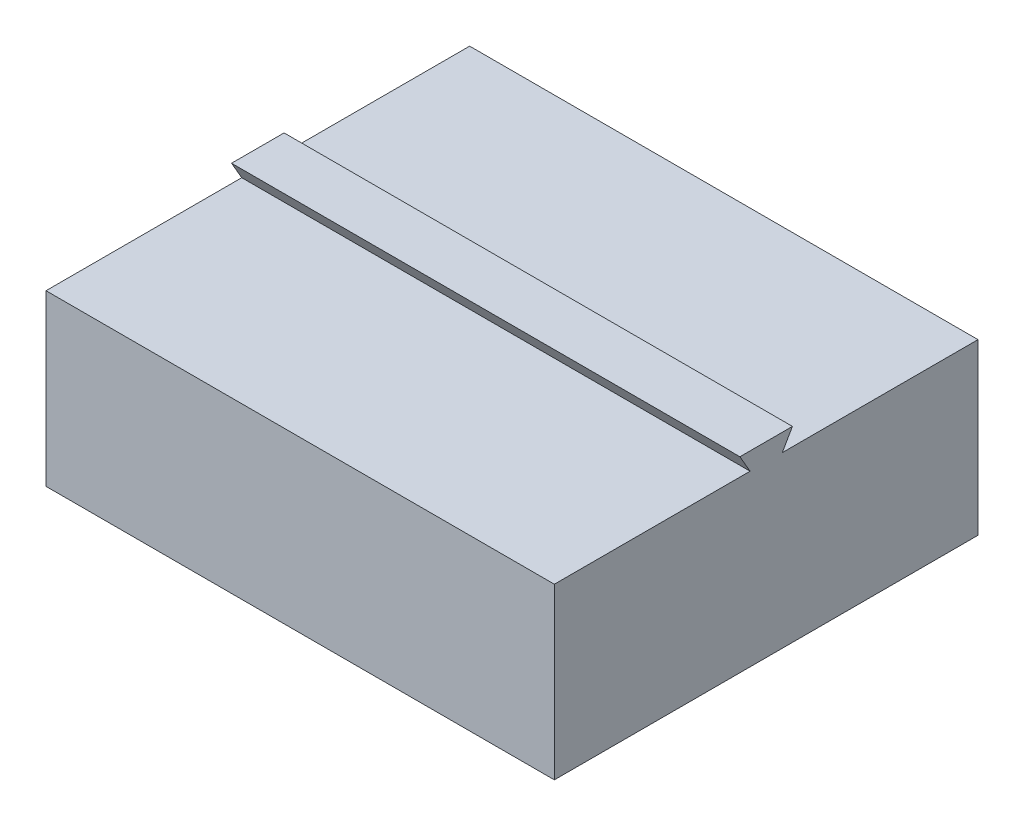
ISO-10303-21;
HEADER;
FILE_DESCRIPTION(('STEP AP214'),'2;1');
FILE_NAME('part.step','',(''),(''),'','','');
FILE_SCHEMA(('AUTOMOTIVE_DESIGN { 1 0 10303 214 1 1 1 1 }'));
ENDSEC;
DATA;
#1=APPLICATION_CONTEXT('core data for automotive mechanical design processes');
#2=APPLICATION_PROTOCOL_DEFINITION('international standard','automotive_design',2000,#1);
#3=PRODUCT_CONTEXT('',#1,'mechanical');
#4=PRODUCT('Part','Part','',(#3));
#5=PRODUCT_RELATED_PRODUCT_CATEGORY('part','',(#4));
#6=PRODUCT_DEFINITION_FORMATION('','',#4);
#7=PRODUCT_DEFINITION_CONTEXT('part definition',#1,'design');
#8=PRODUCT_DEFINITION('design','',#6,#7);
#9=PRODUCT_DEFINITION_SHAPE('','',#8);
#10=(LENGTH_UNIT() NAMED_UNIT(*) SI_UNIT(.MILLI.,.METRE.));
#11=(NAMED_UNIT(*) PLANE_ANGLE_UNIT() SI_UNIT($,.RADIAN.));
#12=(NAMED_UNIT(*) SI_UNIT($,.STERADIAN.) SOLID_ANGLE_UNIT());
#13=UNCERTAINTY_MEASURE_WITH_UNIT(LENGTH_MEASURE(1.E-05),#10,'distance_accuracy_value','');
#14=(GEOMETRIC_REPRESENTATION_CONTEXT(3) GLOBAL_UNCERTAINTY_ASSIGNED_CONTEXT((#13)) GLOBAL_UNIT_ASSIGNED_CONTEXT((#10,
#11,#12)) REPRESENTATION_CONTEXT('',''));
#15=CARTESIAN_POINT('',(0.,0.,0.));
#16=DIRECTION('',(0.,0.,1.));
#17=DIRECTION('',(1.,0.,0.));
#18=AXIS2_PLACEMENT_3D('',#15,#16,#17);
#19=CARTESIAN_POINT('',(0.,40.,0.));
#20=DIRECTION('',(0.,1.,0.));
#21=DIRECTION('',(0.,0.,1.));
#22=AXIS2_PLACEMENT_3D('',#19,#20,#21);
#23=PLANE('',#22);
#24=DIRECTION('',(0.,0.,1.));
#25=VECTOR('',#24,1.);
#26=CARTESIAN_POINT('',(-60.,40.,50.));
#27=LINE('',#26,#25);
#28=CARTESIAN_POINT('',(-60.,40.,-50.));
#29=VERTEX_POINT('',#28);
#30=CARTESIAN_POINT('',(-60.,40.,-3.8));
#31=VERTEX_POINT('',#30);
#32=EDGE_CURVE('E231',#29,#31,#27,.T.);
#33=ORIENTED_EDGE('',*,*,#32,.T.);
#34=DIRECTION('',(1.,0.,0.));
#35=VECTOR('',#34,1.);
#36=CARTESIAN_POINT('',(-73.0825745851545,40.,-3.8));
#37=LINE('',#36,#35);
#38=CARTESIAN_POINT('',(60.,40.,-3.79999999999998));
#39=VERTEX_POINT('',#38);
#40=EDGE_CURVE('E60',#31,#39,#37,.T.);
#41=ORIENTED_EDGE('',*,*,#40,.T.);
#42=DIRECTION('',(0.,0.,-1.));
#43=VECTOR('',#42,1.);
#44=CARTESIAN_POINT('',(60.,40.,50.));
#45=LINE('',#44,#43);
#46=CARTESIAN_POINT('',(60.,40.,-50.));
#47=VERTEX_POINT('',#46);
#48=EDGE_CURVE('E236',#39,#47,#45,.T.);
#49=ORIENTED_EDGE('',*,*,#48,.T.);
#50=DIRECTION('',(-1.,0.,0.));
#51=VECTOR('',#50,1.);
#52=CARTESIAN_POINT('',(60.,40.,-50.));
#53=LINE('',#52,#51);
#54=EDGE_CURVE('E239',#47,#29,#53,.T.);
#55=ORIENTED_EDGE('',*,*,#54,.T.);
#56=EDGE_LOOP('',(#33,#41,#49,#55));
#57=FACE_BOUND('',#56,.T.);
#58=ADVANCED_FACE('F37',(#57),#23,.T.);
#59=CARTESIAN_POINT('',(-60.,40.,50.));
#60=DIRECTION('',(1.,0.,0.));
#61=DIRECTION('',(0.,0.,-1.));
#62=AXIS2_PLACEMENT_3D('',#59,#60,#61);
#63=PLANE('',#62);
#64=DIRECTION('',(0.,0.,1.));
#65=VECTOR('',#64,1.);
#66=CARTESIAN_POINT('',(-60.,0.,50.));
#67=LINE('',#66,#65);
#68=CARTESIAN_POINT('',(-60.,0.,-50.));
#69=VERTEX_POINT('',#68);
#70=CARTESIAN_POINT('',(-60.,0.,50.));
#71=VERTEX_POINT('',#70);
#72=EDGE_CURVE('E230',#69,#71,#67,.T.);
#73=ORIENTED_EDGE('',*,*,#72,.T.);
#74=DIRECTION('',(0.,-1.,0.));
#75=VECTOR('',#74,1.);
#76=CARTESIAN_POINT('',(-60.,40.,50.));
#77=LINE('',#76,#75);
#78=CARTESIAN_POINT('',(-60.,40.,50.));
#79=VERTEX_POINT('',#78);
#80=EDGE_CURVE('E11',#79,#71,#77,.T.);
#81=ORIENTED_EDGE('',*,*,#80,.F.);
#82=CARTESIAN_POINT('',(-60.,40.,3.8));
#83=VERTEX_POINT('',#82);
#84=EDGE_CURVE('E234',#83,#79,#27,.T.);
#85=ORIENTED_EDGE('',*,*,#84,.F.);
#86=DIRECTION('',(0.,0.866025403784436,0.500000000000005));
#87=VECTOR('',#86,1.);
#88=CARTESIAN_POINT('',(-60.,40.,3.8));
#89=LINE('',#88,#87);
#90=CARTESIAN_POINT('',(-60.,44.16,6.20177711982887));
#91=VERTEX_POINT('',#90);
#92=EDGE_CURVE('E209',#83,#91,#89,.T.);
#93=ORIENTED_EDGE('',*,*,#92,.T.);
#94=DIRECTION('',(0.,0.,-1.));
#95=VECTOR('',#94,1.);
#96=CARTESIAN_POINT('',(-60.,44.16,6.20177711982887));
#97=LINE('',#96,#95);
#98=CARTESIAN_POINT('',(-60.,44.16,-6.20177711982887));
#99=VERTEX_POINT('',#98);
#100=EDGE_CURVE('E207',#91,#99,#97,.T.);
#101=ORIENTED_EDGE('',*,*,#100,.T.);
#102=DIRECTION('',(0.,-0.866025403784436,0.500000000000005));
#103=VECTOR('',#102,1.);
#104=CARTESIAN_POINT('',(-60.,44.16,-6.20177711982887));
#105=LINE('',#104,#103);
#106=EDGE_CURVE('E212',#99,#31,#105,.T.);
#107=ORIENTED_EDGE('',*,*,#106,.T.);
#108=ORIENTED_EDGE('',*,*,#32,.F.);
#109=DIRECTION('',(0.,-1.,0.));
#110=VECTOR('',#109,1.);
#111=CARTESIAN_POINT('',(-60.,40.,-50.));
#112=LINE('',#111,#110);
#113=EDGE_CURVE('E241',#29,#69,#112,.T.);
#114=ORIENTED_EDGE('',*,*,#113,.T.);
#115=EDGE_LOOP('',(#73,#81,#85,#93,#101,#107,#108,#114));
#116=FACE_BOUND('',#115,.T.);
#117=ADVANCED_FACE('F39',(#116),#63,.F.);
#118=CARTESIAN_POINT('',(60.,40.,50.));
#119=DIRECTION('',(0.,0.,-1.));
#120=DIRECTION('',(-1.,0.,0.));
#121=AXIS2_PLACEMENT_3D('',#118,#119,#120);
#122=PLANE('',#121);
#123=DIRECTION('',(1.,0.,0.));
#124=VECTOR('',#123,1.);
#125=CARTESIAN_POINT('',(60.,0.,50.));
#126=LINE('',#125,#124);
#127=CARTESIAN_POINT('',(60.,0.,50.));
#128=VERTEX_POINT('',#127);
#129=EDGE_CURVE('E244',#71,#128,#126,.T.);
#130=ORIENTED_EDGE('',*,*,#129,.T.);
#131=DIRECTION('',(0.,-1.,0.));
#132=VECTOR('',#131,1.);
#133=CARTESIAN_POINT('',(60.,40.,50.));
#134=LINE('',#133,#132);
#135=CARTESIAN_POINT('',(60.,40.,50.));
#136=VERTEX_POINT('',#135);
#137=EDGE_CURVE('E45',#136,#128,#134,.T.);
#138=ORIENTED_EDGE('',*,*,#137,.F.);
#139=DIRECTION('',(1.,0.,0.));
#140=VECTOR('',#139,1.);
#141=CARTESIAN_POINT('',(60.,40.,50.));
#142=LINE('',#141,#140);
#143=EDGE_CURVE('E233',#79,#136,#142,.T.);
#144=ORIENTED_EDGE('',*,*,#143,.F.);
#145=ORIENTED_EDGE('',*,*,#80,.T.);
#146=EDGE_LOOP('',(#130,#138,#144,#145));
#147=FACE_BOUND('',#146,.T.);
#148=ADVANCED_FACE('F291',(#147),#122,.F.);
#149=CARTESIAN_POINT('',(60.,40.,50.));
#150=DIRECTION('',(-1.,0.,0.));
#151=DIRECTION('',(0.,0.,1.));
#152=AXIS2_PLACEMENT_3D('',#149,#150,#151);
#153=PLANE('',#152);
#154=DIRECTION('',(0.,0.,-1.));
#155=VECTOR('',#154,1.);
#156=CARTESIAN_POINT('',(60.,0.,50.));
#157=LINE('',#156,#155);
#158=CARTESIAN_POINT('',(60.,0.,-50.));
#159=VERTEX_POINT('',#158);
#160=EDGE_CURVE('E246',#128,#159,#157,.T.);
#161=ORIENTED_EDGE('',*,*,#160,.T.);
#162=DIRECTION('',(0.,-1.,0.));
#163=VECTOR('',#162,1.);
#164=CARTESIAN_POINT('',(60.,40.,-50.));
#165=LINE('',#164,#163);
#166=EDGE_CURVE('E252',#47,#159,#165,.T.);
#167=ORIENTED_EDGE('',*,*,#166,.F.);
#168=ORIENTED_EDGE('',*,*,#48,.F.);
#169=DIRECTION('',(0.,0.866025403784436,-0.500000000000004));
#170=VECTOR('',#169,1.);
#171=CARTESIAN_POINT('',(60.,44.16,-6.20177711982887));
#172=LINE('',#171,#170);
#173=CARTESIAN_POINT('',(60.,44.16,-6.20177711982887));
#174=VERTEX_POINT('',#173);
#175=EDGE_CURVE('E197',#39,#174,#172,.T.);
#176=ORIENTED_EDGE('',*,*,#175,.T.);
#177=DIRECTION('',(0.,0.,1.));
#178=VECTOR('',#177,1.);
#179=CARTESIAN_POINT('',(60.,44.16,6.20177711982887));
#180=LINE('',#179,#178);
#181=CARTESIAN_POINT('',(60.,44.16,6.20177711982887));
#182=VERTEX_POINT('',#181);
#183=EDGE_CURVE('E215',#174,#182,#180,.T.);
#184=ORIENTED_EDGE('',*,*,#183,.T.);
#185=DIRECTION('',(0.,-0.866025403784436,-0.500000000000005));
#186=VECTOR('',#185,1.);
#187=CARTESIAN_POINT('',(60.,40.,3.8));
#188=LINE('',#187,#186);
#189=CARTESIAN_POINT('',(60.,40.,3.8));
#190=VERTEX_POINT('',#189);
#191=EDGE_CURVE('E218',#182,#190,#188,.T.);
#192=ORIENTED_EDGE('',*,*,#191,.T.);
#193=EDGE_CURVE('E237',#136,#190,#45,.T.);
#194=ORIENTED_EDGE('',*,*,#193,.F.);
#195=ORIENTED_EDGE('',*,*,#137,.T.);
#196=EDGE_LOOP('',(#161,#167,#168,#176,#184,#192,#194,#195));
#197=FACE_BOUND('',#196,.T.);
#198=ADVANCED_FACE('F259',(#197),#153,.F.);
#199=CARTESIAN_POINT('',(60.,40.,-50.));
#200=DIRECTION('',(0.,0.,1.));
#201=DIRECTION('',(1.,0.,0.));
#202=AXIS2_PLACEMENT_3D('',#199,#200,#201);
#203=PLANE('',#202);
#204=DIRECTION('',(-1.,0.,0.));
#205=VECTOR('',#204,1.);
#206=CARTESIAN_POINT('',(60.,0.,-50.));
#207=LINE('',#206,#205);
#208=EDGE_CURVE('E248',#159,#69,#207,.T.);
#209=ORIENTED_EDGE('',*,*,#208,.T.);
#210=ORIENTED_EDGE('',*,*,#113,.F.);
#211=ORIENTED_EDGE('',*,*,#54,.F.);
#212=ORIENTED_EDGE('',*,*,#166,.T.);
#213=EDGE_LOOP('',(#209,#210,#211,#212));
#214=FACE_BOUND('',#213,.T.);
#215=ADVANCED_FACE('F269',(#214),#203,.F.);
#216=DIRECTION('',(1.,0.,0.));
#217=VECTOR('',#216,1.);
#218=CARTESIAN_POINT('',(-73.0825745851545,40.,3.8));
#219=LINE('',#218,#217);
#220=EDGE_CURVE('E210',#83,#190,#219,.T.);
#221=ORIENTED_EDGE('',*,*,#220,.F.);
#222=ORIENTED_EDGE('',*,*,#84,.T.);
#223=ORIENTED_EDGE('',*,*,#143,.T.);
#224=ORIENTED_EDGE('',*,*,#193,.T.);
#225=EDGE_LOOP('',(#221,#222,#223,#224));
#226=FACE_BOUND('',#225,.T.);
#227=ADVANCED_FACE('F290',(#226),#23,.T.);
#228=CARTESIAN_POINT('',(0.,0.,0.));
#229=DIRECTION('',(0.,1.,0.));
#230=DIRECTION('',(0.,0.,1.));
#231=AXIS2_PLACEMENT_3D('',#228,#229,#230);
#232=PLANE('',#231);
#233=DIRECTION('',(0.,0.,1.));
#234=VECTOR('',#233,1.);
#235=CARTESIAN_POINT('',(10.8887433026897,0.,13.3243832519748));
#236=LINE('',#235,#234);
#237=CARTESIAN_POINT('',(10.8887433026897,0.,-30.1350746666546));
#238=VERTEX_POINT('',#237);
#239=CARTESIAN_POINT('',(10.8887433026897,0.,13.3243832519748));
#240=VERTEX_POINT('',#239);
#241=EDGE_CURVE('E182',#238,#240,#236,.T.);
#242=ORIENTED_EDGE('',*,*,#241,.F.);
#243=DIRECTION('',(1.,0.,0.));
#244=VECTOR('',#243,1.);
#245=CARTESIAN_POINT('',(10.8887433026897,0.,-30.1350746666546));
#246=LINE('',#245,#244);
#247=CARTESIAN_POINT('',(-10.8887433026829,0.,-30.1350746666546));
#248=VERTEX_POINT('',#247);
#249=EDGE_CURVE('E52',#248,#238,#246,.T.);
#250=ORIENTED_EDGE('',*,*,#249,.F.);
#251=DIRECTION('',(0.,0.,-1.));
#252=VECTOR('',#251,1.);
#253=CARTESIAN_POINT('',(-10.8887433026829,0.,-30.1350746666546));
#254=LINE('',#253,#252);
#255=CARTESIAN_POINT('',(-10.8887433026829,0.,13.3243832519748));
#256=VERTEX_POINT('',#255);
#257=EDGE_CURVE('E165',#256,#248,#254,.T.);
#258=ORIENTED_EDGE('',*,*,#257,.F.);
#259=DIRECTION('',(1.,0.,0.));
#260=VECTOR('',#259,1.);
#261=CARTESIAN_POINT('',(-10.8887433026829,0.,13.3243832519748));
#262=LINE('',#261,#260);
#263=CARTESIAN_POINT('',(-25.4837020685664,0.,13.3243832519748));
#264=VERTEX_POINT('',#263);
#265=EDGE_CURVE('E168',#264,#256,#262,.T.);
#266=ORIENTED_EDGE('',*,*,#265,.F.);
#267=DIRECTION('',(-0.683415844772554,0.,-0.73002930291449));
#268=VECTOR('',#267,1.);
#269=CARTESIAN_POINT('',(-25.4837020685664,0.,13.3243832519748));
#270=LINE('',#269,#268);
#271=CARTESIAN_POINT('',(3.41637121107795E-12,0.,40.5462415087));
#272=VERTEX_POINT('',#271);
#273=EDGE_CURVE('E190',#272,#264,#270,.T.);
#274=ORIENTED_EDGE('',*,*,#273,.F.);
#275=DIRECTION('',(-0.683415844772554,0.,0.73002930291449));
#276=VECTOR('',#275,1.);
#277=CARTESIAN_POINT('',(3.41637121107795E-12,0.,40.5462415087));
#278=LINE('',#277,#276);
#279=CARTESIAN_POINT('',(25.4837020685733,0.,13.3243832519748));
#280=VERTEX_POINT('',#279);
#281=EDGE_CURVE('E187',#280,#272,#278,.T.);
#282=ORIENTED_EDGE('',*,*,#281,.F.);
#283=DIRECTION('',(1.,0.,0.));
#284=VECTOR('',#283,1.);
#285=CARTESIAN_POINT('',(25.4837020685733,0.,13.3243832519748));
#286=LINE('',#285,#284);
#287=EDGE_CURVE('E184',#240,#280,#286,.T.);
#288=ORIENTED_EDGE('',*,*,#287,.F.);
#289=EDGE_LOOP('',(#242,#250,#258,#266,#274,#282,#288));
#290=FACE_BOUND('',#289,.T.);
#291=ORIENTED_EDGE('',*,*,#72,.F.);
#292=ORIENTED_EDGE('',*,*,#208,.F.);
#293=ORIENTED_EDGE('',*,*,#160,.F.);
#294=ORIENTED_EDGE('',*,*,#129,.F.);
#295=EDGE_LOOP('',(#291,#292,#293,#294));
#296=FACE_BOUND('',#295,.T.);
#297=ADVANCED_FACE('F266',(#290,#296),#232,.F.);
#298=CARTESIAN_POINT('',(-73.0825745851545,40.,3.8));
#299=DIRECTION('',(0.,-0.500000000000005,0.866025403784436));
#300=DIRECTION('',(0.,-0.866025403784436,-0.500000000000005));
#301=AXIS2_PLACEMENT_3D('',#298,#299,#300);
#302=PLANE('',#301);
#303=ORIENTED_EDGE('',*,*,#92,.F.);
#304=ORIENTED_EDGE('',*,*,#220,.T.);
#305=ORIENTED_EDGE('',*,*,#191,.F.);
#306=DIRECTION('',(1.,0.,0.));
#307=VECTOR('',#306,1.);
#308=CARTESIAN_POINT('',(-73.0825745851545,44.16,6.20177711982887));
#309=LINE('',#308,#307);
#310=EDGE_CURVE('E223',#91,#182,#309,.T.);
#311=ORIENTED_EDGE('',*,*,#310,.F.);
#312=EDGE_LOOP('',(#303,#304,#305,#311));
#313=FACE_BOUND('',#312,.T.);
#314=ADVANCED_FACE('F287',(#313),#302,.T.);
#315=CARTESIAN_POINT('',(-73.0825745851545,44.16,6.20177711982887));
#316=DIRECTION('',(0.,1.,0.));
#317=DIRECTION('',(0.,0.,1.));
#318=AXIS2_PLACEMENT_3D('',#315,#316,#317);
#319=PLANE('',#318);
#320=ORIENTED_EDGE('',*,*,#100,.F.);
#321=ORIENTED_EDGE('',*,*,#310,.T.);
#322=ORIENTED_EDGE('',*,*,#183,.F.);
#323=DIRECTION('',(1.,0.,0.));
#324=VECTOR('',#323,1.);
#325=CARTESIAN_POINT('',(-73.0825745851545,44.16,-6.20177711982887));
#326=LINE('',#325,#324);
#327=EDGE_CURVE('E225',#99,#174,#326,.T.);
#328=ORIENTED_EDGE('',*,*,#327,.F.);
#329=EDGE_LOOP('',(#320,#321,#322,#328));
#330=FACE_BOUND('',#329,.T.);
#331=ADVANCED_FACE('F282',(#330),#319,.T.);
#332=CARTESIAN_POINT('',(-73.0825745851545,44.16,-6.20177711982887));
#333=DIRECTION('',(0.,-0.500000000000004,-0.866025403784436));
#334=DIRECTION('',(0.,0.866025403784436,-0.500000000000005));
#335=AXIS2_PLACEMENT_3D('',#332,#333,#334);
#336=PLANE('',#335);
#337=ORIENTED_EDGE('',*,*,#106,.F.);
#338=ORIENTED_EDGE('',*,*,#327,.T.);
#339=ORIENTED_EDGE('',*,*,#175,.F.);
#340=ORIENTED_EDGE('',*,*,#40,.F.);
#341=EDGE_LOOP('',(#337,#338,#339,#340));
#342=FACE_BOUND('',#341,.T.);
#343=ADVANCED_FACE('F277',(#342),#336,.T.);
#344=CARTESIAN_POINT('',(10.8887433026897,1.,-30.1350746666546));
#345=DIRECTION('',(0.,0.,-1.));
#346=DIRECTION('',(-1.,0.,0.));
#347=AXIS2_PLACEMENT_3D('',#344,#345,#346);
#348=PLANE('',#347);
#349=ORIENTED_EDGE('',*,*,#249,.T.);
#350=DIRECTION('',(0.,-1.,0.));
#351=VECTOR('',#350,1.);
#352=CARTESIAN_POINT('',(10.8887433026897,1.,-30.1350746666546));
#353=LINE('',#352,#351);
#354=CARTESIAN_POINT('',(10.8887433026897,1.,-30.1350746666546));
#355=VERTEX_POINT('',#354);
#356=EDGE_CURVE('E142',#355,#238,#353,.T.);
#357=ORIENTED_EDGE('',*,*,#356,.F.);
#358=DIRECTION('',(1.,0.,0.));
#359=VECTOR('',#358,1.);
#360=CARTESIAN_POINT('',(10.8887433026897,1.,-30.1350746666546));
#361=LINE('',#360,#359);
#362=CARTESIAN_POINT('',(-10.8887433026829,1.,-30.1350746666546));
#363=VERTEX_POINT('',#362);
#364=EDGE_CURVE('E146',#363,#355,#361,.T.);
#365=ORIENTED_EDGE('',*,*,#364,.F.);
#366=DIRECTION('',(0.,-1.,0.));
#367=VECTOR('',#366,1.);
#368=CARTESIAN_POINT('',(-10.8887433026829,1.,-30.1350746666546));
#369=LINE('',#368,#367);
#370=EDGE_CURVE('E195',#363,#248,#369,.T.);
#371=ORIENTED_EDGE('',*,*,#370,.T.);
#372=EDGE_LOOP('',(#349,#357,#365,#371));
#373=FACE_BOUND('',#372,.T.);
#374=ADVANCED_FACE('F144',(#373),#348,.F.);
#375=CARTESIAN_POINT('',(-10.8887433026829,1.,-30.1350746666546));
#376=DIRECTION('',(-1.,0.,0.));
#377=DIRECTION('',(0.,0.,1.));
#378=AXIS2_PLACEMENT_3D('',#375,#376,#377);
#379=PLANE('',#378);
#380=ORIENTED_EDGE('',*,*,#257,.T.);
#381=ORIENTED_EDGE('',*,*,#370,.F.);
#382=DIRECTION('',(0.,0.,-1.));
#383=VECTOR('',#382,1.);
#384=CARTESIAN_POINT('',(-10.8887433026829,1.,-30.1350746666546));
#385=LINE('',#384,#383);
#386=CARTESIAN_POINT('',(-10.8887433026829,1.,13.3243832519748));
#387=VERTEX_POINT('',#386);
#388=EDGE_CURVE('E152',#387,#363,#385,.T.);
#389=ORIENTED_EDGE('',*,*,#388,.F.);
#390=DIRECTION('',(0.,-1.,0.));
#391=VECTOR('',#390,1.);
#392=CARTESIAN_POINT('',(-10.8887433026829,1.,13.3243832519748));
#393=LINE('',#392,#391);
#394=EDGE_CURVE('E198',#387,#256,#393,.T.);
#395=ORIENTED_EDGE('',*,*,#394,.T.);
#396=EDGE_LOOP('',(#380,#381,#389,#395));
#397=FACE_BOUND('',#396,.T.);
#398=ADVANCED_FACE('F365',(#397),#379,.F.);
#399=CARTESIAN_POINT('',(-10.8887433026829,1.,13.3243832519748));
#400=DIRECTION('',(0.,0.,-1.));
#401=DIRECTION('',(-1.,0.,0.));
#402=AXIS2_PLACEMENT_3D('',#399,#400,#401);
#403=PLANE('',#402);
#404=ORIENTED_EDGE('',*,*,#265,.T.);
#405=ORIENTED_EDGE('',*,*,#394,.F.);
#406=DIRECTION('',(1.,0.,0.));
#407=VECTOR('',#406,1.);
#408=CARTESIAN_POINT('',(-10.8887433026829,1.,13.3243832519748));
#409=LINE('',#408,#407);
#410=CARTESIAN_POINT('',(-25.4837020685664,1.,13.3243832519748));
#411=VERTEX_POINT('',#410);
#412=EDGE_CURVE('E178',#411,#387,#409,.T.);
#413=ORIENTED_EDGE('',*,*,#412,.F.);
#414=DIRECTION('',(0.,-1.,0.));
#415=VECTOR('',#414,1.);
#416=CARTESIAN_POINT('',(-25.4837020685664,1.,13.3243832519748));
#417=LINE('',#416,#415);
#418=EDGE_CURVE('E200',#411,#264,#417,.T.);
#419=ORIENTED_EDGE('',*,*,#418,.T.);
#420=EDGE_LOOP('',(#404,#405,#413,#419));
#421=FACE_BOUND('',#420,.T.);
#422=ADVANCED_FACE('F374',(#421),#403,.F.);
#423=CARTESIAN_POINT('',(-25.4837020685664,1.,13.3243832519748));
#424=DIRECTION('',(-0.73002930291449,0.,0.683415844772554));
#425=DIRECTION('',(0.683415844772554,0.,0.73002930291449));
#426=AXIS2_PLACEMENT_3D('',#423,#424,#425);
#427=PLANE('',#426);
#428=ORIENTED_EDGE('',*,*,#273,.T.);
#429=ORIENTED_EDGE('',*,*,#418,.F.);
#430=DIRECTION('',(-0.683415844772554,0.,-0.73002930291449));
#431=VECTOR('',#430,1.);
#432=CARTESIAN_POINT('',(-25.4837020685664,1.,13.3243832519748));
#433=LINE('',#432,#431);
#434=CARTESIAN_POINT('',(3.41637121107795E-12,1.,40.5462415087));
#435=VERTEX_POINT('',#434);
#436=EDGE_CURVE('E175',#435,#411,#433,.T.);
#437=ORIENTED_EDGE('',*,*,#436,.F.);
#438=DIRECTION('',(0.,-1.,0.));
#439=VECTOR('',#438,1.);
#440=CARTESIAN_POINT('',(3.41637121107795E-12,1.,40.5462415087));
#441=LINE('',#440,#439);
#442=EDGE_CURVE('E202',#435,#272,#441,.T.);
#443=ORIENTED_EDGE('',*,*,#442,.T.);
#444=EDGE_LOOP('',(#428,#429,#437,#443));
#445=FACE_BOUND('',#444,.T.);
#446=ADVANCED_FACE('F384',(#445),#427,.F.);
#447=CARTESIAN_POINT('',(3.41637121107795E-12,1.,40.5462415087));
#448=DIRECTION('',(0.73002930291449,0.,0.683415844772554));
#449=DIRECTION('',(0.683415844772554,0.,-0.73002930291449));
#450=AXIS2_PLACEMENT_3D('',#447,#448,#449);
#451=PLANE('',#450);
#452=ORIENTED_EDGE('',*,*,#281,.T.);
#453=ORIENTED_EDGE('',*,*,#442,.F.);
#454=DIRECTION('',(-0.683415844772554,0.,0.73002930291449));
#455=VECTOR('',#454,1.);
#456=CARTESIAN_POINT('',(3.41637121107795E-12,1.,40.5462415087));
#457=LINE('',#456,#455);
#458=CARTESIAN_POINT('',(25.4837020685733,1.,13.3243832519748));
#459=VERTEX_POINT('',#458);
#460=EDGE_CURVE('E172',#459,#435,#457,.T.);
#461=ORIENTED_EDGE('',*,*,#460,.F.);
#462=DIRECTION('',(0.,-1.,0.));
#463=VECTOR('',#462,1.);
#464=CARTESIAN_POINT('',(25.4837020685733,1.,13.3243832519748));
#465=LINE('',#464,#463);
#466=EDGE_CURVE('E204',#459,#280,#465,.T.);
#467=ORIENTED_EDGE('',*,*,#466,.T.);
#468=EDGE_LOOP('',(#452,#453,#461,#467));
#469=FACE_BOUND('',#468,.T.);
#470=ADVANCED_FACE('F394',(#469),#451,.F.);
#471=CARTESIAN_POINT('',(25.4837020685733,1.,13.3243832519748));
#472=DIRECTION('',(0.,0.,-1.));
#473=DIRECTION('',(-1.,0.,0.));
#474=AXIS2_PLACEMENT_3D('',#471,#472,#473);
#475=PLANE('',#474);
#476=ORIENTED_EDGE('',*,*,#287,.T.);
#477=ORIENTED_EDGE('',*,*,#466,.F.);
#478=DIRECTION('',(1.,0.,0.));
#479=VECTOR('',#478,1.);
#480=CARTESIAN_POINT('',(25.4837020685733,1.,13.3243832519748));
#481=LINE('',#480,#479);
#482=CARTESIAN_POINT('',(10.8887433026897,1.,13.3243832519748));
#483=VERTEX_POINT('',#482);
#484=EDGE_CURVE('E160',#483,#459,#481,.T.);
#485=ORIENTED_EDGE('',*,*,#484,.F.);
#486=DIRECTION('',(0.,-1.,0.));
#487=VECTOR('',#486,1.);
#488=CARTESIAN_POINT('',(10.8887433026897,1.,13.3243832519748));
#489=LINE('',#488,#487);
#490=EDGE_CURVE('E151',#483,#240,#489,.T.);
#491=ORIENTED_EDGE('',*,*,#490,.T.);
#492=EDGE_LOOP('',(#476,#477,#485,#491));
#493=FACE_BOUND('',#492,.T.);
#494=ADVANCED_FACE('F404',(#493),#475,.F.);
#495=CARTESIAN_POINT('',(10.8887433026897,1.,13.3243832519748));
#496=DIRECTION('',(1.,0.,0.));
#497=DIRECTION('',(0.,0.,-1.));
#498=AXIS2_PLACEMENT_3D('',#495,#496,#497);
#499=PLANE('',#498);
#500=ORIENTED_EDGE('',*,*,#241,.T.);
#501=ORIENTED_EDGE('',*,*,#490,.F.);
#502=DIRECTION('',(0.,0.,1.));
#503=VECTOR('',#502,1.);
#504=CARTESIAN_POINT('',(10.8887433026897,1.,13.3243832519748));
#505=LINE('',#504,#503);
#506=EDGE_CURVE('E155',#355,#483,#505,.T.);
#507=ORIENTED_EDGE('',*,*,#506,.F.);
#508=ORIENTED_EDGE('',*,*,#356,.T.);
#509=EDGE_LOOP('',(#500,#501,#507,#508));
#510=FACE_BOUND('',#509,.T.);
#511=ADVANCED_FACE('F156',(#510),#499,.F.);
#512=CARTESIAN_POINT('',(0.,1.,0.));
#513=DIRECTION('',(0.,1.,0.));
#514=DIRECTION('',(0.,0.,1.));
#515=AXIS2_PLACEMENT_3D('',#512,#513,#514);
#516=PLANE('',#515);
#517=ORIENTED_EDGE('',*,*,#364,.T.);
#518=ORIENTED_EDGE('',*,*,#506,.T.);
#519=ORIENTED_EDGE('',*,*,#484,.T.);
#520=ORIENTED_EDGE('',*,*,#460,.T.);
#521=ORIENTED_EDGE('',*,*,#436,.T.);
#522=ORIENTED_EDGE('',*,*,#412,.T.);
#523=ORIENTED_EDGE('',*,*,#388,.T.);
#524=EDGE_LOOP('',(#517,#518,#519,#520,#521,#522,#523));
#525=FACE_BOUND('',#524,.T.);
#526=ADVANCED_FACE('F162',(#525),#516,.F.);
#527=CLOSED_SHELL('',(#58,#117,#148,#198,#215,#227,#297,#314,#331,#343,#374,#398,#422,#446,#470,
#494,#511,#526));
#528=MANIFOLD_SOLID_BREP('B2',#527);
#529=ADVANCED_BREP_SHAPE_REPRESENTATION('',(#18,#528),#14);
#530=SHAPE_DEFINITION_REPRESENTATION(#9,#529);
ENDSEC;
END-ISO-10303-21;
